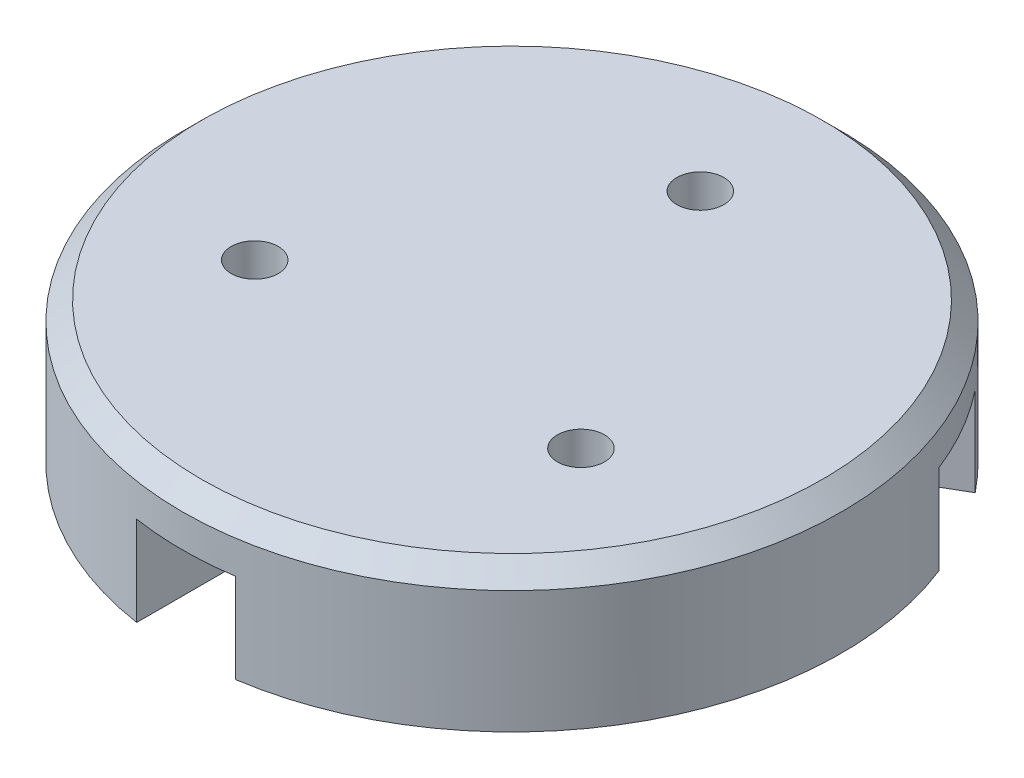
ISO-10303-21;
HEADER;
FILE_DESCRIPTION(('STEP AP214'),'2;1');
FILE_NAME('part.step','',(''),(''),'','','');
FILE_SCHEMA(('AUTOMOTIVE_DESIGN { 1 0 10303 214 1 1 1 1 }'));
ENDSEC;
DATA;
#1=APPLICATION_CONTEXT('core data for automotive mechanical design processes');
#2=APPLICATION_PROTOCOL_DEFINITION('international standard','automotive_design',2000,#1);
#3=PRODUCT_CONTEXT('',#1,'mechanical');
#4=PRODUCT('Part','Part','',(#3));
#5=PRODUCT_RELATED_PRODUCT_CATEGORY('part','',(#4));
#6=PRODUCT_DEFINITION_FORMATION('','',#4);
#7=PRODUCT_DEFINITION_CONTEXT('part definition',#1,'design');
#8=PRODUCT_DEFINITION('design','',#6,#7);
#9=PRODUCT_DEFINITION_SHAPE('','',#8);
#10=(LENGTH_UNIT() NAMED_UNIT(*) SI_UNIT(.MILLI.,.METRE.));
#11=(NAMED_UNIT(*) PLANE_ANGLE_UNIT() SI_UNIT($,.RADIAN.));
#12=(NAMED_UNIT(*) SI_UNIT($,.STERADIAN.) SOLID_ANGLE_UNIT());
#13=UNCERTAINTY_MEASURE_WITH_UNIT(LENGTH_MEASURE(1.E-05),#10,'distance_accuracy_value','');
#14=(GEOMETRIC_REPRESENTATION_CONTEXT(3) GLOBAL_UNCERTAINTY_ASSIGNED_CONTEXT((#13)) GLOBAL_UNIT_ASSIGNED_CONTEXT((#10,
#11,#12)) REPRESENTATION_CONTEXT('',''));
#15=CARTESIAN_POINT('',(0.,0.,0.));
#16=DIRECTION('',(0.,0.,1.));
#17=DIRECTION('',(1.,0.,0.));
#18=AXIS2_PLACEMENT_3D('',#15,#16,#17);
#19=CARTESIAN_POINT('',(0.,3.,0.));
#20=DIRECTION('',(0.,-1.,0.));
#21=DIRECTION('',(0.,0.,-1.));
#22=AXIS2_PLACEMENT_3D('',#19,#20,#21);
#23=CYLINDRICAL_SURFACE('',#22,7.);
#24=CARTESIAN_POINT('',(0.,2.6,0.));
#25=DIRECTION('',(0.,1.,0.));
#26=DIRECTION('',(0.,0.,1.));
#27=AXIS2_PLACEMENT_3D('',#24,#25,#26);
#28=CIRCLE('',#27,7.);
#29=CARTESIAN_POINT('',(0.,2.6,7.));
#30=VERTEX_POINT('',#29);
#31=EDGE_CURVE('E11',#30,#30,#28,.F.);
#32=ORIENTED_EDGE('',*,*,#31,.T.);
#33=EDGE_LOOP('',(#32));
#34=FACE_BOUND('',#33,.T.);
#35=CARTESIAN_POINT('',(0.,0.,0.));
#36=DIRECTION('',(0.,1.,0.));
#37=DIRECTION('',(0.,0.,1.));
#38=AXIS2_PLACEMENT_3D('',#35,#36,#37);
#39=CIRCLE('',#38,7.);
#40=CARTESIAN_POINT('',(-6.51859405713975,0.,-2.5510647812673));
#41=VERTEX_POINT('',#40);
#42=CARTESIAN_POINT('',(-1.05007038960765,0.,6.92079129701722));
#43=VERTEX_POINT('',#42);
#44=EDGE_CURVE('E240',#41,#43,#39,.T.);
#45=ORIENTED_EDGE('',*,*,#44,.T.);
#46=DIRECTION('',(0.,-1.,0.));
#47=VECTOR('',#46,1.);
#48=CARTESIAN_POINT('',(-1.05007038960765,3.,6.92079129701722));
#49=LINE('',#48,#47);
#50=CARTESIAN_POINT('',(-1.05007038960765,1.9,6.92079129701722));
#51=VERTEX_POINT('',#50);
#52=EDGE_CURVE('E237',#43,#51,#49,.F.);
#53=ORIENTED_EDGE('',*,*,#52,.T.);
#54=CARTESIAN_POINT('',(0.,1.9,0.));
#55=DIRECTION('',(0.,-1.,0.));
#56=DIRECTION('',(0.,0.,-1.));
#57=AXIS2_PLACEMENT_3D('',#54,#55,#56);
#58=CIRCLE('',#57,7.);
#59=CARTESIAN_POINT('',(1.04992961039235,1.9,6.92081265555002));
#60=VERTEX_POINT('',#59);
#61=EDGE_CURVE('E141',#60,#51,#58,.T.);
#62=ORIENTED_EDGE('',*,*,#61,.F.);
#63=DIRECTION('',(0.,-1.,0.));
#64=VECTOR('',#63,1.);
#65=CARTESIAN_POINT('',(1.04992961039235,3.,6.92081265555002));
#66=LINE('',#65,#64);
#67=CARTESIAN_POINT('',(1.04992961039235,0.,6.92081265555002));
#68=VERTEX_POINT('',#67);
#69=EDGE_CURVE('E233',#60,#68,#66,.T.);
#70=ORIENTED_EDGE('',*,*,#69,.T.);
#71=CARTESIAN_POINT('',(6.51856811062593,0.,-2.5511310799586));
#72=VERTEX_POINT('',#71);
#73=EDGE_CURVE('E241',#68,#72,#39,.T.);
#74=ORIENTED_EDGE('',*,*,#73,.T.);
#75=DIRECTION('',(0.,-1.,0.));
#76=VECTOR('',#75,1.);
#77=CARTESIAN_POINT('',(6.51856811062593,3.,-2.5511310799586));
#78=LINE('',#77,#76);
#79=CARTESIAN_POINT('',(6.51856811062593,1.9,-2.5511310799586));
#80=VERTEX_POINT('',#79);
#81=EDGE_CURVE('E229',#72,#80,#78,.F.);
#82=ORIENTED_EDGE('',*,*,#81,.T.);
#83=CARTESIAN_POINT('',(0.,1.9,0.));
#84=DIRECTION('',(0.,-1.,0.));
#85=DIRECTION('',(0.,0.,-1.));
#86=AXIS2_PLACEMENT_3D('',#83,#84,#85);
#87=CIRCLE('',#86,7.);
#88=CARTESIAN_POINT('',(5.46855227327448,1.9,-4.36977528420679));
#89=VERTEX_POINT('',#88);
#90=EDGE_CURVE('E259',#89,#80,#87,.T.);
#91=ORIENTED_EDGE('',*,*,#90,.F.);
#92=DIRECTION('',(0.,-1.,0.));
#93=VECTOR('',#92,1.);
#94=CARTESIAN_POINT('',(5.46855227327447,3.,-4.36977528420679));
#95=LINE('',#94,#93);
#96=CARTESIAN_POINT('',(5.46855227327448,0.,-4.36977528420679));
#97=VERTEX_POINT('',#96);
#98=EDGE_CURVE('E225',#89,#97,#95,.T.);
#99=ORIENTED_EDGE('',*,*,#98,.T.);
#100=CARTESIAN_POINT('',(-5.46859671682021,0.,-4.36971966478208));
#101=VERTEX_POINT('',#100);
#102=EDGE_CURVE('E246',#97,#101,#39,.T.);
#103=ORIENTED_EDGE('',*,*,#102,.T.);
#104=DIRECTION('',(0.,-1.,0.));
#105=VECTOR('',#104,1.);
#106=CARTESIAN_POINT('',(-5.46859671682021,3.,-4.36971966478208));
#107=LINE('',#106,#105);
#108=CARTESIAN_POINT('',(-5.46859671682021,1.9,-4.36971966478208));
#109=VERTEX_POINT('',#108);
#110=EDGE_CURVE('E221',#101,#109,#107,.F.);
#111=ORIENTED_EDGE('',*,*,#110,.T.);
#112=CARTESIAN_POINT('',(0.,1.9,0.));
#113=DIRECTION('',(0.,-1.,0.));
#114=DIRECTION('',(0.,0.,-1.));
#115=AXIS2_PLACEMENT_3D('',#112,#113,#114);
#116=CIRCLE('',#115,7.);
#117=CARTESIAN_POINT('',(-6.51859405713975,1.9,-2.5510647812673));
#118=VERTEX_POINT('',#117);
#119=EDGE_CURVE('E256',#118,#109,#116,.T.);
#120=ORIENTED_EDGE('',*,*,#119,.F.);
#121=DIRECTION('',(0.,-1.,0.));
#122=VECTOR('',#121,1.);
#123=CARTESIAN_POINT('',(-6.51859405713975,3.,-2.5510647812673));
#124=LINE('',#123,#122);
#125=EDGE_CURVE('E170',#118,#41,#124,.T.);
#126=ORIENTED_EDGE('',*,*,#125,.T.);
#127=EDGE_LOOP('',(#45,#53,#62,#70,#74,#82,#91,#99,#103,#111,#120,#126));
#128=FACE_BOUND('',#127,.T.);
#129=ADVANCED_FACE('F41',(#34,#128),#23,.T.);
#130=CARTESIAN_POINT('',(0.,3.,0.));
#131=DIRECTION('',(0.,1.,0.));
#132=DIRECTION('',(0.,0.,1.));
#133=AXIS2_PLACEMENT_3D('',#130,#131,#132);
#134=PLANE('',#133);
#135=CARTESIAN_POINT('',(0.,3.,0.));
#136=DIRECTION('',(0.,1.,0.));
#137=DIRECTION('',(0.,0.,1.));
#138=AXIS2_PLACEMENT_3D('',#135,#136,#137);
#139=CIRCLE('',#138,6.6);
#140=CARTESIAN_POINT('',(0.,3.,6.6));
#141=VERTEX_POINT('',#140);
#142=EDGE_CURVE('E51',#141,#141,#139,.T.);
#143=ORIENTED_EDGE('',*,*,#142,.T.);
#144=EDGE_LOOP('',(#143));
#145=FACE_BOUND('',#144,.T.);
#146=CARTESIAN_POINT('',(0.,3.,-4.));
#147=DIRECTION('',(0.,-1.,0.));
#148=DIRECTION('',(0.,0.,-1.));
#149=AXIS2_PLACEMENT_3D('',#146,#147,#148);
#150=CIRCLE('',#149,0.5);
#151=CARTESIAN_POINT('',(0.,3.,-4.5));
#152=VERTEX_POINT('',#151);
#153=EDGE_CURVE('E273',#152,#152,#150,.T.);
#154=ORIENTED_EDGE('',*,*,#153,.T.);
#155=EDGE_LOOP('',(#154));
#156=FACE_BOUND('',#155,.T.);
#157=CARTESIAN_POINT('',(-3.46410161513775,3.,2.));
#158=DIRECTION('',(0.,-1.,0.));
#159=DIRECTION('',(0.,0.,-1.));
#160=AXIS2_PLACEMENT_3D('',#157,#158,#159);
#161=CIRCLE('',#160,0.5);
#162=CARTESIAN_POINT('',(-3.46410161513775,3.,1.5));
#163=VERTEX_POINT('',#162);
#164=EDGE_CURVE('E369',#163,#163,#161,.T.);
#165=ORIENTED_EDGE('',*,*,#164,.T.);
#166=EDGE_LOOP('',(#165));
#167=FACE_BOUND('',#166,.T.);
#168=CARTESIAN_POINT('',(3.46410161513776,3.,2.));
#169=DIRECTION('',(0.,-1.,0.));
#170=DIRECTION('',(0.,0.,-1.));
#171=AXIS2_PLACEMENT_3D('',#168,#169,#170);
#172=CIRCLE('',#171,0.5);
#173=CARTESIAN_POINT('',(3.46410161513776,3.,1.5));
#174=VERTEX_POINT('',#173);
#175=EDGE_CURVE('E402',#174,#174,#172,.T.);
#176=ORIENTED_EDGE('',*,*,#175,.T.);
#177=EDGE_LOOP('',(#176));
#178=FACE_BOUND('',#177,.T.);
#179=ADVANCED_FACE('F284',(#145,#156,#167,#178),#134,.T.);
#180=CARTESIAN_POINT('',(0.,0.,0.));
#181=DIRECTION('',(0.,1.,0.));
#182=DIRECTION('',(0.,0.,1.));
#183=AXIS2_PLACEMENT_3D('',#180,#181,#182);
#184=PLANE('',#183);
#185=CARTESIAN_POINT('',(0.,0.,-4.));
#186=DIRECTION('',(0.,1.,0.));
#187=DIRECTION('',(0.,0.,1.));
#188=AXIS2_PLACEMENT_3D('',#185,#186,#187);
#189=CIRCLE('',#188,0.5);
#190=CARTESIAN_POINT('',(0.,0.,-3.5));
#191=VERTEX_POINT('',#190);
#192=EDGE_CURVE('E277',#191,#191,#189,.T.);
#193=ORIENTED_EDGE('',*,*,#192,.T.);
#194=EDGE_LOOP('',(#193));
#195=FACE_BOUND('',#194,.T.);
#196=CARTESIAN_POINT('',(-3.46410161513775,0.,2.));
#197=DIRECTION('',(0.,1.,0.));
#198=DIRECTION('',(0.,0.,1.));
#199=AXIS2_PLACEMENT_3D('',#196,#197,#198);
#200=CIRCLE('',#199,0.5);
#201=CARTESIAN_POINT('',(-3.46410161513775,0.,2.5));
#202=VERTEX_POINT('',#201);
#203=EDGE_CURVE('E272',#202,#202,#200,.T.);
#204=ORIENTED_EDGE('',*,*,#203,.T.);
#205=EDGE_LOOP('',(#204));
#206=FACE_BOUND('',#205,.T.);
#207=CARTESIAN_POINT('',(3.46410161513776,0.,2.));
#208=DIRECTION('',(0.,1.,0.));
#209=DIRECTION('',(0.,0.,1.));
#210=AXIS2_PLACEMENT_3D('',#207,#208,#209);
#211=CIRCLE('',#210,0.5);
#212=CARTESIAN_POINT('',(3.46410161513776,0.,2.5));
#213=VERTEX_POINT('',#212);
#214=EDGE_CURVE('E268',#213,#213,#211,.T.);
#215=ORIENTED_EDGE('',*,*,#214,.T.);
#216=EDGE_LOOP('',(#215));
#217=FACE_BOUND('',#216,.T.);
#218=CARTESIAN_POINT('',(0.,0.,0.));
#219=DIRECTION('',(0.,1.,0.));
#220=DIRECTION('',(0.,0.,1.));
#221=AXIS2_PLACEMENT_3D('',#218,#219,#220);
#222=CIRCLE('',#221,1.05);
#223=CARTESIAN_POINT('',(0.,0.,1.05));
#224=VERTEX_POINT('',#223);
#225=EDGE_CURVE('E211',#224,#224,#222,.F.);
#226=ORIENTED_EDGE('',*,*,#225,.F.);
#227=EDGE_LOOP('',(#226));
#228=FACE_BOUND('',#227,.T.);
#229=DIRECTION('',(1.,0.,0.));
#230=VECTOR('',#229,1.);
#231=CARTESIAN_POINT('',(-1.05007038960765,0.,1.99997104760297));
#232=LINE('',#231,#230);
#233=CARTESIAN_POINT('',(-1.05007038960765,0.,1.99997104760297));
#234=VERTEX_POINT('',#233);
#235=CARTESIAN_POINT('',(1.04992961039235,0.,1.99997104760297));
#236=VERTEX_POINT('',#235);
#237=EDGE_CURVE('E163',#234,#236,#232,.T.);
#238=ORIENTED_EDGE('',*,*,#237,.F.);
#239=DIRECTION('',(0.,0.,1.));
#240=VECTOR('',#239,1.);
#241=CARTESIAN_POINT('',(-1.05007038960765,0.,0.));
#242=LINE('',#241,#240);
#243=EDGE_CURVE('E149',#234,#43,#242,.T.);
#244=ORIENTED_EDGE('',*,*,#243,.T.);
#245=ORIENTED_EDGE('',*,*,#44,.F.);
#246=DIRECTION('',(-0.866025403784439,0.,-0.5));
#247=VECTOR('',#246,1.);
#248=CARTESIAN_POINT('',(-10.917375235021,0.,-5.09070227842327));
#249=LINE('',#248,#247);
#250=CARTESIAN_POINT('',(-2.25712119717657,0.,-0.0907022784232695));
#251=VERTEX_POINT('',#250);
#252=EDGE_CURVE('E198',#251,#41,#249,.T.);
#253=ORIENTED_EDGE('',*,*,#252,.F.);
#254=DIRECTION('',(-0.5,0.,0.866025403784438));
#255=VECTOR('',#254,1.);
#256=CARTESIAN_POINT('',(-1.20712119717647,0.,-1.90935562637077));
#257=LINE('',#256,#255);
#258=CARTESIAN_POINT('',(-1.20712119717647,0.,-1.90935562637077));
#259=VERTEX_POINT('',#258);
#260=EDGE_CURVE('E207',#259,#251,#257,.T.);
#261=ORIENTED_EDGE('',*,*,#260,.F.);
#262=DIRECTION('',(-0.866025403784439,0.,-0.5));
#263=VECTOR('',#262,1.);
#264=CARTESIAN_POINT('',(0.5249949393538,0.,-0.909317908677322));
#265=LINE('',#264,#263);
#266=EDGE_CURVE('E245',#259,#101,#265,.T.);
#267=ORIENTED_EDGE('',*,*,#266,.T.);
#268=ORIENTED_EDGE('',*,*,#102,.F.);
#269=DIRECTION('',(0.866025403784439,0.,-0.5));
#270=VECTOR('',#269,1.);
#271=CARTESIAN_POINT('',(9.86723445580559,0.,-6.90935562637075));
#272=LINE('',#271,#270);
#273=CARTESIAN_POINT('',(1.2069804179612,0.,-1.90935562637074));
#274=VERTEX_POINT('',#273);
#275=EDGE_CURVE('E176',#274,#97,#272,.T.);
#276=ORIENTED_EDGE('',*,*,#275,.F.);
#277=DIRECTION('',(-0.5,0.,-0.866025403784438));
#278=VECTOR('',#277,1.);
#279=CARTESIAN_POINT('',(2.2569804179612,0.,-0.0907022784234221));
#280=LINE('',#279,#278);
#281=CARTESIAN_POINT('',(2.2569804179612,0.,-0.090702278423422));
#282=VERTEX_POINT('',#281);
#283=EDGE_CURVE('E184',#282,#274,#280,.T.);
#284=ORIENTED_EDGE('',*,*,#283,.F.);
#285=DIRECTION('',(0.866025403784439,0.,-0.5));
#286=VECTOR('',#285,1.);
#287=CARTESIAN_POINT('',(0.524969865842396,0.,0.909274480081646));
#288=LINE('',#287,#286);
#289=EDGE_CURVE('E250',#282,#72,#288,.T.);
#290=ORIENTED_EDGE('',*,*,#289,.T.);
#291=ORIENTED_EDGE('',*,*,#73,.F.);
#292=DIRECTION('',(0.,0.,1.));
#293=VECTOR('',#292,1.);
#294=CARTESIAN_POINT('',(1.04992961039235,0.,11.999971047603));
#295=LINE('',#294,#293);
#296=EDGE_CURVE('E145',#236,#68,#295,.T.);
#297=ORIENTED_EDGE('',*,*,#296,.F.);
#298=EDGE_LOOP('',(#238,#244,#245,#253,#261,#267,#268,#276,#284,#290,#291,#297));
#299=FACE_BOUND('',#298,.T.);
#300=ADVANCED_FACE('F302',(#195,#206,#217,#228,#299),#184,.F.);
#301=CARTESIAN_POINT('',(0.,1.9,0.));
#302=DIRECTION('',(0.,-1.,0.));
#303=DIRECTION('',(0.,0.,-1.));
#304=AXIS2_PLACEMENT_3D('',#301,#302,#303);
#305=PLANE('',#304);
#306=ORIENTED_EDGE('',*,*,#119,.T.);
#307=DIRECTION('',(0.866025403784439,0.,0.5));
#308=VECTOR('',#307,1.);
#309=CARTESIAN_POINT('',(-9.86737523502086,1.9,-6.90935562637077));
#310=LINE('',#309,#308);
#311=CARTESIAN_POINT('',(-1.20712119717647,1.9,-1.90935562637077));
#312=VERTEX_POINT('',#311);
#313=EDGE_CURVE('E194',#109,#312,#310,.T.);
#314=ORIENTED_EDGE('',*,*,#313,.T.);
#315=DIRECTION('',(-0.5,0.,0.866025403784438));
#316=VECTOR('',#315,1.);
#317=CARTESIAN_POINT('',(-1.20712119717647,1.9,-1.90935562637077));
#318=LINE('',#317,#316);
#319=CARTESIAN_POINT('',(-2.25712119717657,1.9,-0.0907022784232695));
#320=VERTEX_POINT('',#319);
#321=EDGE_CURVE('E197',#312,#320,#318,.T.);
#322=ORIENTED_EDGE('',*,*,#321,.T.);
#323=DIRECTION('',(-0.866025403784439,0.,-0.5));
#324=VECTOR('',#323,1.);
#325=CARTESIAN_POINT('',(-10.917375235021,1.9,-5.09070227842327));
#326=LINE('',#325,#324);
#327=EDGE_CURVE('E202',#320,#118,#326,.T.);
#328=ORIENTED_EDGE('',*,*,#327,.T.);
#329=EDGE_LOOP('',(#306,#314,#322,#328));
#330=FACE_BOUND('',#329,.T.);
#331=ADVANCED_FACE('F307',(#330),#305,.T.);
#332=CARTESIAN_POINT('',(-9.86737523502086,1.9,-6.90935562637077));
#333=DIRECTION('',(0.5,0.,-0.866025403784438));
#334=DIRECTION('',(-0.866025403784439,0.,-0.5));
#335=AXIS2_PLACEMENT_3D('',#332,#333,#334);
#336=PLANE('',#335);
#337=ORIENTED_EDGE('',*,*,#266,.F.);
#338=DIRECTION('',(0.,-1.,0.));
#339=VECTOR('',#338,1.);
#340=CARTESIAN_POINT('',(-1.20712119717647,1.9,-1.90935562637077));
#341=LINE('',#340,#339);
#342=EDGE_CURVE('E206',#312,#259,#341,.T.);
#343=ORIENTED_EDGE('',*,*,#342,.F.);
#344=ORIENTED_EDGE('',*,*,#313,.F.);
#345=ORIENTED_EDGE('',*,*,#110,.F.);
#346=EDGE_LOOP('',(#337,#343,#344,#345));
#347=FACE_BOUND('',#346,.T.);
#348=ADVANCED_FACE('F310',(#347),#336,.F.);
#349=CARTESIAN_POINT('',(-10.917375235021,1.9,-5.09070227842327));
#350=DIRECTION('',(-0.5,0.,0.866025403784438));
#351=DIRECTION('',(0.866025403784439,0.,0.5));
#352=AXIS2_PLACEMENT_3D('',#349,#350,#351);
#353=PLANE('',#352);
#354=ORIENTED_EDGE('',*,*,#327,.F.);
#355=DIRECTION('',(0.,-1.,0.));
#356=VECTOR('',#355,1.);
#357=CARTESIAN_POINT('',(-2.25712119717657,1.9,-0.0907022784232695));
#358=LINE('',#357,#356);
#359=EDGE_CURVE('E187',#320,#251,#358,.T.);
#360=ORIENTED_EDGE('',*,*,#359,.T.);
#361=ORIENTED_EDGE('',*,*,#252,.T.);
#362=ORIENTED_EDGE('',*,*,#125,.F.);
#363=EDGE_LOOP('',(#354,#360,#361,#362));
#364=FACE_BOUND('',#363,.T.);
#365=ADVANCED_FACE('F313',(#364),#353,.F.);
#366=CARTESIAN_POINT('',(-1.20712119717647,1.9,-1.90935562637077));
#367=DIRECTION('',(0.866025403784438,0.,0.5));
#368=DIRECTION('',(0.5,0.,-0.866025403784439));
#369=AXIS2_PLACEMENT_3D('',#366,#367,#368);
#370=PLANE('',#369);
#371=ORIENTED_EDGE('',*,*,#260,.T.);
#372=ORIENTED_EDGE('',*,*,#359,.F.);
#373=ORIENTED_EDGE('',*,*,#321,.F.);
#374=ORIENTED_EDGE('',*,*,#342,.T.);
#375=EDGE_LOOP('',(#371,#372,#373,#374));
#376=FACE_BOUND('',#375,.T.);
#377=ADVANCED_FACE('F315',(#376),#370,.F.);
#378=CARTESIAN_POINT('',(0.,1.9,0.));
#379=DIRECTION('',(0.,-1.,0.));
#380=DIRECTION('',(0.,0.,-1.));
#381=AXIS2_PLACEMENT_3D('',#378,#379,#380);
#382=PLANE('',#381);
#383=ORIENTED_EDGE('',*,*,#90,.T.);
#384=DIRECTION('',(-0.866025403784439,0.,0.5));
#385=VECTOR('',#384,1.);
#386=CARTESIAN_POINT('',(10.9172344558056,1.9,-5.09070227842343));
#387=LINE('',#386,#385);
#388=CARTESIAN_POINT('',(2.2569804179612,1.9,-0.0907022784234221));
#389=VERTEX_POINT('',#388);
#390=EDGE_CURVE('E172',#80,#389,#387,.T.);
#391=ORIENTED_EDGE('',*,*,#390,.T.);
#392=DIRECTION('',(-0.5,0.,-0.866025403784438));
#393=VECTOR('',#392,1.);
#394=CARTESIAN_POINT('',(2.2569804179612,1.9,-0.0907022784234221));
#395=LINE('',#394,#393);
#396=CARTESIAN_POINT('',(1.2069804179612,1.9,-1.90935562637074));
#397=VERTEX_POINT('',#396);
#398=EDGE_CURVE('E175',#389,#397,#395,.T.);
#399=ORIENTED_EDGE('',*,*,#398,.T.);
#400=DIRECTION('',(0.866025403784439,0.,-0.5));
#401=VECTOR('',#400,1.);
#402=CARTESIAN_POINT('',(9.86723445580559,1.9,-6.90935562637075));
#403=LINE('',#402,#401);
#404=EDGE_CURVE('E180',#397,#89,#403,.T.);
#405=ORIENTED_EDGE('',*,*,#404,.T.);
#406=EDGE_LOOP('',(#383,#391,#399,#405));
#407=FACE_BOUND('',#406,.T.);
#408=ADVANCED_FACE('F318',(#407),#382,.T.);
#409=CARTESIAN_POINT('',(10.9172344558056,1.9,-5.09070227842343));
#410=DIRECTION('',(0.5,0.,0.866025403784438));
#411=DIRECTION('',(0.866025403784439,0.,-0.5));
#412=AXIS2_PLACEMENT_3D('',#409,#410,#411);
#413=PLANE('',#412);
#414=ORIENTED_EDGE('',*,*,#289,.F.);
#415=DIRECTION('',(0.,-1.,0.));
#416=VECTOR('',#415,1.);
#417=CARTESIAN_POINT('',(2.2569804179612,1.9,-0.0907022784234221));
#418=LINE('',#417,#416);
#419=EDGE_CURVE('E66',#389,#282,#418,.T.);
#420=ORIENTED_EDGE('',*,*,#419,.F.);
#421=ORIENTED_EDGE('',*,*,#390,.F.);
#422=ORIENTED_EDGE('',*,*,#81,.F.);
#423=EDGE_LOOP('',(#414,#420,#421,#422));
#424=FACE_BOUND('',#423,.T.);
#425=ADVANCED_FACE('F326',(#424),#413,.F.);
#426=CARTESIAN_POINT('',(9.86723445580559,1.9,-6.90935562637075));
#427=DIRECTION('',(-0.5,0.,-0.866025403784438));
#428=DIRECTION('',(-0.866025403784439,0.,0.5));
#429=AXIS2_PLACEMENT_3D('',#426,#427,#428);
#430=PLANE('',#429);
#431=ORIENTED_EDGE('',*,*,#404,.F.);
#432=DIRECTION('',(0.,-1.,0.));
#433=VECTOR('',#432,1.);
#434=CARTESIAN_POINT('',(1.2069804179612,1.9,-1.90935562637074));
#435=LINE('',#434,#433);
#436=EDGE_CURVE('E166',#397,#274,#435,.T.);
#437=ORIENTED_EDGE('',*,*,#436,.T.);
#438=ORIENTED_EDGE('',*,*,#275,.T.);
#439=ORIENTED_EDGE('',*,*,#98,.F.);
#440=EDGE_LOOP('',(#431,#437,#438,#439));
#441=FACE_BOUND('',#440,.T.);
#442=ADVANCED_FACE('F329',(#441),#430,.F.);
#443=CARTESIAN_POINT('',(2.2569804179612,1.9,-0.0907022784234221));
#444=DIRECTION('',(-0.866025403784439,0.,0.5));
#445=DIRECTION('',(0.5,0.,0.866025403784439));
#446=AXIS2_PLACEMENT_3D('',#443,#444,#445);
#447=PLANE('',#446);
#448=ORIENTED_EDGE('',*,*,#283,.T.);
#449=ORIENTED_EDGE('',*,*,#436,.F.);
#450=ORIENTED_EDGE('',*,*,#398,.F.);
#451=ORIENTED_EDGE('',*,*,#419,.T.);
#452=EDGE_LOOP('',(#448,#449,#450,#451));
#453=FACE_BOUND('',#452,.T.);
#454=ADVANCED_FACE('F331',(#453),#447,.F.);
#455=CARTESIAN_POINT('',(0.,1.9,0.));
#456=DIRECTION('',(0.,-1.,0.));
#457=DIRECTION('',(0.,0.,-1.));
#458=AXIS2_PLACEMENT_3D('',#455,#456,#457);
#459=PLANE('',#458);
#460=ORIENTED_EDGE('',*,*,#61,.T.);
#461=DIRECTION('',(0.,0.,-1.));
#462=VECTOR('',#461,1.);
#463=CARTESIAN_POINT('',(-1.05007038960765,1.9,11.999971047603));
#464=LINE('',#463,#462);
#465=CARTESIAN_POINT('',(-1.05007038960765,1.9,1.99997104760297));
#466=VERTEX_POINT('',#465);
#467=EDGE_CURVE('E136',#51,#466,#464,.T.);
#468=ORIENTED_EDGE('',*,*,#467,.T.);
#469=DIRECTION('',(1.,0.,0.));
#470=VECTOR('',#469,1.);
#471=CARTESIAN_POINT('',(-1.05007038960765,1.9,1.99997104760297));
#472=LINE('',#471,#470);
#473=CARTESIAN_POINT('',(1.04992961039235,1.9,1.99997104760297));
#474=VERTEX_POINT('',#473);
#475=EDGE_CURVE('E139',#466,#474,#472,.T.);
#476=ORIENTED_EDGE('',*,*,#475,.T.);
#477=DIRECTION('',(0.,0.,1.));
#478=VECTOR('',#477,1.);
#479=CARTESIAN_POINT('',(1.04992961039235,1.9,11.999971047603));
#480=LINE('',#479,#478);
#481=EDGE_CURVE('E153',#474,#60,#480,.T.);
#482=ORIENTED_EDGE('',*,*,#481,.T.);
#483=EDGE_LOOP('',(#460,#468,#476,#482));
#484=FACE_BOUND('',#483,.T.);
#485=ADVANCED_FACE('F137',(#484),#459,.T.);
#486=CARTESIAN_POINT('',(-1.05007038960765,1.9,11.999971047603));
#487=DIRECTION('',(-1.,0.,0.));
#488=DIRECTION('',(0.,0.,1.));
#489=AXIS2_PLACEMENT_3D('',#486,#487,#488);
#490=PLANE('',#489);
#491=ORIENTED_EDGE('',*,*,#243,.F.);
#492=DIRECTION('',(0.,-1.,0.));
#493=VECTOR('',#492,1.);
#494=CARTESIAN_POINT('',(-1.05007038960765,1.9,1.99997104760297));
#495=LINE('',#494,#493);
#496=EDGE_CURVE('E58',#466,#234,#495,.T.);
#497=ORIENTED_EDGE('',*,*,#496,.F.);
#498=ORIENTED_EDGE('',*,*,#467,.F.);
#499=ORIENTED_EDGE('',*,*,#52,.F.);
#500=EDGE_LOOP('',(#491,#497,#498,#499));
#501=FACE_BOUND('',#500,.T.);
#502=ADVANCED_FACE('F147',(#501),#490,.F.);
#503=CARTESIAN_POINT('',(1.04992961039235,1.9,11.999971047603));
#504=DIRECTION('',(1.,0.,0.));
#505=DIRECTION('',(0.,0.,-1.));
#506=AXIS2_PLACEMENT_3D('',#503,#504,#505);
#507=PLANE('',#506);
#508=ORIENTED_EDGE('',*,*,#481,.F.);
#509=DIRECTION('',(0.,-1.,0.));
#510=VECTOR('',#509,1.);
#511=CARTESIAN_POINT('',(1.04992961039235,1.9,1.99997104760297));
#512=LINE('',#511,#510);
#513=EDGE_CURVE('E152',#474,#236,#512,.T.);
#514=ORIENTED_EDGE('',*,*,#513,.T.);
#515=ORIENTED_EDGE('',*,*,#296,.T.);
#516=ORIENTED_EDGE('',*,*,#69,.F.);
#517=EDGE_LOOP('',(#508,#514,#515,#516));
#518=FACE_BOUND('',#517,.T.);
#519=ADVANCED_FACE('F342',(#518),#507,.F.);
#520=CARTESIAN_POINT('',(-1.05007038960765,1.9,1.99997104760297));
#521=DIRECTION('',(0.,0.,-1.));
#522=DIRECTION('',(-1.,0.,0.));
#523=AXIS2_PLACEMENT_3D('',#520,#521,#522);
#524=PLANE('',#523);
#525=ORIENTED_EDGE('',*,*,#237,.T.);
#526=ORIENTED_EDGE('',*,*,#513,.F.);
#527=ORIENTED_EDGE('',*,*,#475,.F.);
#528=ORIENTED_EDGE('',*,*,#496,.T.);
#529=EDGE_LOOP('',(#525,#526,#527,#528));
#530=FACE_BOUND('',#529,.T.);
#531=ADVANCED_FACE('F155',(#530),#524,.F.);
#532=CARTESIAN_POINT('',(0.,-1.2E-05,0.));
#533=DIRECTION('',(0.,1.,0.));
#534=DIRECTION('',(0.,0.,1.));
#535=AXIS2_PLACEMENT_3D('',#532,#533,#534);
#536=CYLINDRICAL_SURFACE('',#535,1.05);
#537=CARTESIAN_POINT('',(0.,2.5,0.));
#538=DIRECTION('',(0.,-1.,0.));
#539=DIRECTION('',(0.,0.,-1.));
#540=AXIS2_PLACEMENT_3D('',#537,#538,#539);
#541=CIRCLE('',#540,1.05);
#542=CARTESIAN_POINT('',(0.,2.5,-1.05));
#543=VERTEX_POINT('',#542);
#544=EDGE_CURVE('E267',#543,#543,#541,.T.);
#545=ORIENTED_EDGE('',*,*,#544,.F.);
#546=EDGE_LOOP('',(#545));
#547=FACE_BOUND('',#546,.T.);
#548=ORIENTED_EDGE('',*,*,#225,.T.);
#549=EDGE_LOOP('',(#548));
#550=FACE_BOUND('',#549,.T.);
#551=ADVANCED_FACE('F345',(#547,#550),#536,.F.);
#552=CARTESIAN_POINT('',(0.,2.5,0.));
#553=DIRECTION('',(0.,-1.,0.));
#554=DIRECTION('',(0.,0.,-1.));
#555=AXIS2_PLACEMENT_3D('',#552,#553,#554);
#556=PLANE('',#555);
#557=ORIENTED_EDGE('',*,*,#544,.T.);
#558=EDGE_LOOP('',(#557));
#559=FACE_BOUND('',#558,.T.);
#560=ADVANCED_FACE('F353',(#559),#556,.T.);
#561=CARTESIAN_POINT('',(3.46410161513776,3.,2.));
#562=DIRECTION('',(0.,-1.,0.));
#563=DIRECTION('',(0.,0.,-1.));
#564=AXIS2_PLACEMENT_3D('',#561,#562,#563);
#565=CYLINDRICAL_SURFACE('',#564,0.5);
#566=ORIENTED_EDGE('',*,*,#175,.F.);
#567=EDGE_LOOP('',(#566));
#568=FACE_BOUND('',#567,.T.);
#569=ORIENTED_EDGE('',*,*,#214,.F.);
#570=EDGE_LOOP('',(#569));
#571=FACE_BOUND('',#570,.T.);
#572=ADVANCED_FACE('F357',(#568,#571),#565,.F.);
#573=CARTESIAN_POINT('',(-3.46410161513775,3.,2.));
#574=DIRECTION('',(0.,-1.,0.));
#575=DIRECTION('',(0.,0.,-1.));
#576=AXIS2_PLACEMENT_3D('',#573,#574,#575);
#577=CYLINDRICAL_SURFACE('',#576,0.5);
#578=ORIENTED_EDGE('',*,*,#164,.F.);
#579=EDGE_LOOP('',(#578));
#580=FACE_BOUND('',#579,.T.);
#581=ORIENTED_EDGE('',*,*,#203,.F.);
#582=EDGE_LOOP('',(#581));
#583=FACE_BOUND('',#582,.T.);
#584=ADVANCED_FACE('F293',(#580,#583),#577,.F.);
#585=CARTESIAN_POINT('',(0.,3.,-4.));
#586=DIRECTION('',(0.,-1.,0.));
#587=DIRECTION('',(0.,0.,-1.));
#588=AXIS2_PLACEMENT_3D('',#585,#586,#587);
#589=CYLINDRICAL_SURFACE('',#588,0.5);
#590=ORIENTED_EDGE('',*,*,#153,.F.);
#591=EDGE_LOOP('',(#590));
#592=FACE_BOUND('',#591,.T.);
#593=ORIENTED_EDGE('',*,*,#192,.F.);
#594=EDGE_LOOP('',(#593));
#595=FACE_BOUND('',#594,.T.);
#596=ADVANCED_FACE('F288',(#592,#595),#589,.F.);
#597=CARTESIAN_POINT('',(0.,3.,0.));
#598=DIRECTION('',(0.,-1.,0.));
#599=DIRECTION('',(0.,0.,-1.));
#600=AXIS2_PLACEMENT_3D('',#597,#598,#599);
#601=CONICAL_SURFACE('',#600,6.6,0.785398163397449);
#602=ORIENTED_EDGE('',*,*,#31,.F.);
#603=EDGE_LOOP('',(#602));
#604=FACE_BOUND('',#603,.T.);
#605=ORIENTED_EDGE('',*,*,#142,.F.);
#606=EDGE_LOOP('',(#605));
#607=FACE_BOUND('',#606,.T.);
#608=ADVANCED_FACE('F44',(#604,#607),#601,.T.);
#609=CLOSED_SHELL('',(#129,#179,#300,#331,#348,#365,#377,#408,#425,#442,#454,#485,#502,#519,
#531,#551,#560,#572,#584,#596,#608));
#610=MANIFOLD_SOLID_BREP('B2',#609);
#611=ADVANCED_BREP_SHAPE_REPRESENTATION('',(#18,#610),#14);
#612=SHAPE_DEFINITION_REPRESENTATION(#9,#611);
ENDSEC;
END-ISO-10303-21;
